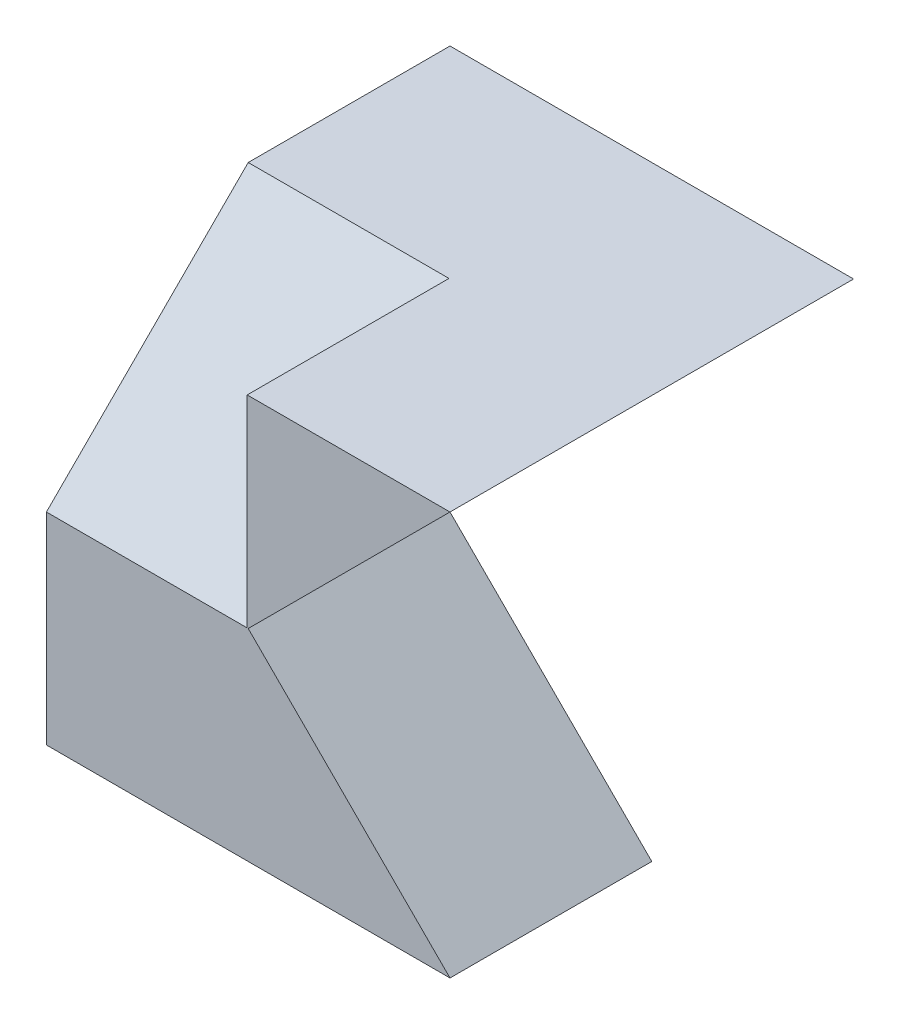
ISO-10303-21;
HEADER;
FILE_DESCRIPTION(('STEP AP214'),'2;1');
FILE_NAME('part.step','',(''),(''),'','','');
FILE_SCHEMA(('AUTOMOTIVE_DESIGN { 1 0 10303 214 1 1 1 1 }'));
ENDSEC;
DATA;
#1=APPLICATION_CONTEXT('core data for automotive mechanical design processes');
#2=APPLICATION_PROTOCOL_DEFINITION('international standard','automotive_design',2000,#1);
#3=PRODUCT_CONTEXT('',#1,'mechanical');
#4=PRODUCT('Part','Part','',(#3));
#5=PRODUCT_RELATED_PRODUCT_CATEGORY('part','',(#4));
#6=PRODUCT_DEFINITION_FORMATION('','',#4);
#7=PRODUCT_DEFINITION_CONTEXT('part definition',#1,'design');
#8=PRODUCT_DEFINITION('design','',#6,#7);
#9=PRODUCT_DEFINITION_SHAPE('','',#8);
#10=(LENGTH_UNIT() NAMED_UNIT(*) SI_UNIT(.MILLI.,.METRE.));
#11=(NAMED_UNIT(*) PLANE_ANGLE_UNIT() SI_UNIT($,.RADIAN.));
#12=(NAMED_UNIT(*) SI_UNIT($,.STERADIAN.) SOLID_ANGLE_UNIT());
#13=UNCERTAINTY_MEASURE_WITH_UNIT(LENGTH_MEASURE(1.E-05),#10,'distance_accuracy_value','');
#14=(GEOMETRIC_REPRESENTATION_CONTEXT(3) GLOBAL_UNCERTAINTY_ASSIGNED_CONTEXT((#13)) GLOBAL_UNIT_ASSIGNED_CONTEXT((#10,
#11,#12)) REPRESENTATION_CONTEXT('',''));
#15=CARTESIAN_POINT('',(0.,0.,0.));
#16=DIRECTION('',(0.,0.,1.));
#17=DIRECTION('',(1.,0.,0.));
#18=AXIS2_PLACEMENT_3D('',#15,#16,#17);
#19=CARTESIAN_POINT('',(4.,0.,4.));
#20=DIRECTION('',(0.,1.,0.));
#21=DIRECTION('',(-1.,0.,0.));
#22=AXIS2_PLACEMENT_3D('',#19,#20,#21);
#23=PLANE('',#22);
#24=DIRECTION('',(0.,0.,-1.));
#25=VECTOR('',#24,1.);
#26=CARTESIAN_POINT('',(0.,0.,4.));
#27=LINE('',#26,#25);
#28=CARTESIAN_POINT('',(0.,0.,4.));
#29=VERTEX_POINT('',#28);
#30=CARTESIAN_POINT('',(0.,0.,2.));
#31=VERTEX_POINT('',#30);
#32=EDGE_CURVE('E118',#29,#31,#27,.T.);
#33=ORIENTED_EDGE('',*,*,#32,.T.);
#34=DIRECTION('',(-1.,0.,0.));
#35=VECTOR('',#34,1.);
#36=CARTESIAN_POINT('',(21.99,0.,2.));
#37=LINE('',#36,#35);
#38=CARTESIAN_POINT('',(4.,0.,2.));
#39=VERTEX_POINT('',#38);
#40=EDGE_CURVE('E100',#39,#31,#37,.T.);
#41=ORIENTED_EDGE('',*,*,#40,.F.);
#42=DIRECTION('',(0.,0.,-1.));
#43=VECTOR('',#42,1.);
#44=CARTESIAN_POINT('',(4.,0.,4.));
#45=LINE('',#44,#43);
#46=CARTESIAN_POINT('',(4.,0.,4.));
#47=VERTEX_POINT('',#46);
#48=EDGE_CURVE('E40',#47,#39,#45,.T.);
#49=ORIENTED_EDGE('',*,*,#48,.F.);
#50=DIRECTION('',(1.,0.,0.));
#51=VECTOR('',#50,1.);
#52=CARTESIAN_POINT('',(4.,0.,4.));
#53=LINE('',#52,#51);
#54=EDGE_CURVE('E122',#29,#47,#53,.T.);
#55=ORIENTED_EDGE('',*,*,#54,.F.);
#56=EDGE_LOOP('',(#33,#41,#49,#55));
#57=FACE_BOUND('',#56,.T.);
#58=ADVANCED_FACE('F33',(#57),#23,.F.);
#59=CARTESIAN_POINT('',(0.,4.,4.));
#60=DIRECTION('',(0.,-1.,0.));
#61=DIRECTION('',(0.,0.,-1.));
#62=AXIS2_PLACEMENT_3D('',#59,#60,#61);
#63=PLANE('',#62);
#64=DIRECTION('',(0.,0.,-1.));
#65=VECTOR('',#64,1.);
#66=CARTESIAN_POINT('',(0.,4.,4.));
#67=LINE('',#66,#65);
#68=CARTESIAN_POINT('',(0.,4.,2.));
#69=VERTEX_POINT('',#68);
#70=CARTESIAN_POINT('',(0.,4.,0.));
#71=VERTEX_POINT('',#70);
#72=EDGE_CURVE('E123',#69,#71,#67,.T.);
#73=ORIENTED_EDGE('',*,*,#72,.F.);
#74=DIRECTION('',(-1.,0.,0.));
#75=VECTOR('',#74,1.);
#76=CARTESIAN_POINT('',(1.99,4.,2.));
#77=LINE('',#76,#75);
#78=CARTESIAN_POINT('',(1.99,4.,2.));
#79=VERTEX_POINT('',#78);
#80=EDGE_CURVE('E166',#79,#69,#77,.T.);
#81=ORIENTED_EDGE('',*,*,#80,.F.);
#82=DIRECTION('',(0.,0.,-1.));
#83=VECTOR('',#82,1.);
#84=CARTESIAN_POINT('',(1.99,4.,4.));
#85=LINE('',#84,#83);
#86=CARTESIAN_POINT('',(1.99,4.,4.));
#87=VERTEX_POINT('',#86);
#88=EDGE_CURVE('E175',#87,#79,#85,.T.);
#89=ORIENTED_EDGE('',*,*,#88,.F.);
#90=DIRECTION('',(-1.,0.,0.));
#91=VECTOR('',#90,1.);
#92=CARTESIAN_POINT('',(0.,4.,4.));
#93=LINE('',#92,#91);
#94=CARTESIAN_POINT('',(4.,4.,4.));
#95=VERTEX_POINT('',#94);
#96=EDGE_CURVE('E128',#95,#87,#93,.T.);
#97=ORIENTED_EDGE('',*,*,#96,.F.);
#98=DIRECTION('',(0.,0.,-1.));
#99=VECTOR('',#98,1.);
#100=CARTESIAN_POINT('',(4.,4.,4.));
#101=LINE('',#100,#99);
#102=CARTESIAN_POINT('',(4.,4.,0.));
#103=VERTEX_POINT('',#102);
#104=EDGE_CURVE('E126',#95,#103,#101,.T.);
#105=ORIENTED_EDGE('',*,*,#104,.T.);
#106=DIRECTION('',(-1.,0.,0.));
#107=VECTOR('',#106,1.);
#108=CARTESIAN_POINT('',(0.,4.,0.));
#109=LINE('',#108,#107);
#110=EDGE_CURVE('E153',#103,#71,#109,.T.);
#111=ORIENTED_EDGE('',*,*,#110,.T.);
#112=EDGE_LOOP('',(#73,#81,#89,#97,#105,#111));
#113=FACE_BOUND('',#112,.T.);
#114=ADVANCED_FACE('F184',(#113),#63,.F.);
#115=CARTESIAN_POINT('',(0.,0.,4.));
#116=DIRECTION('',(1.,0.,0.));
#117=DIRECTION('',(0.,0.,-1.));
#118=AXIS2_PLACEMENT_3D('',#115,#116,#117);
#119=PLANE('',#118);
#120=DIRECTION('',(0.,-1.,0.));
#121=VECTOR('',#120,1.);
#122=CARTESIAN_POINT('',(0.,0.,0.));
#123=LINE('',#122,#121);
#124=CARTESIAN_POINT('',(0.,2.,0.));
#125=VERTEX_POINT('',#124);
#126=EDGE_CURVE('E131',#71,#125,#123,.T.);
#127=ORIENTED_EDGE('',*,*,#126,.T.);
#128=DIRECTION('',(0.,0.,-1.));
#129=VECTOR('',#128,1.);
#130=CARTESIAN_POINT('',(0.,2.,0.));
#131=LINE('',#130,#129);
#132=CARTESIAN_POINT('',(0.,2.,2.));
#133=VERTEX_POINT('',#132);
#134=EDGE_CURVE('E111',#133,#125,#131,.T.);
#135=ORIENTED_EDGE('',*,*,#134,.F.);
#136=DIRECTION('',(0.,1.,0.));
#137=VECTOR('',#136,1.);
#138=CARTESIAN_POINT('',(0.,0.,2.));
#139=LINE('',#138,#137);
#140=EDGE_CURVE('E104',#31,#133,#139,.T.);
#141=ORIENTED_EDGE('',*,*,#140,.F.);
#142=ORIENTED_EDGE('',*,*,#32,.F.);
#143=DIRECTION('',(0.,-1.,0.));
#144=VECTOR('',#143,1.);
#145=CARTESIAN_POINT('',(0.,0.,4.));
#146=LINE('',#145,#144);
#147=CARTESIAN_POINT('',(0.,2.,4.));
#148=VERTEX_POINT('',#147);
#149=EDGE_CURVE('E124',#148,#29,#146,.T.);
#150=ORIENTED_EDGE('',*,*,#149,.F.);
#151=DIRECTION('',(0.,-0.707106781186547,0.707106781186548));
#152=VECTOR('',#151,1.);
#153=CARTESIAN_POINT('',(0.,4.,2.));
#154=LINE('',#153,#152);
#155=EDGE_CURVE('E171',#69,#148,#154,.T.);
#156=ORIENTED_EDGE('',*,*,#155,.F.);
#157=ORIENTED_EDGE('',*,*,#72,.T.);
#158=EDGE_LOOP('',(#127,#135,#141,#142,#150,#156,#157));
#159=FACE_BOUND('',#158,.T.);
#160=ADVANCED_FACE('F116',(#159),#119,.F.);
#161=CARTESIAN_POINT('',(0.,0.,4.));
#162=DIRECTION('',(0.,0.,-1.));
#163=DIRECTION('',(-1.,0.,0.));
#164=AXIS2_PLACEMENT_3D('',#161,#162,#163);
#165=PLANE('',#164);
#166=DIRECTION('',(0.,1.,0.));
#167=VECTOR('',#166,1.);
#168=CARTESIAN_POINT('',(1.99,4.,4.));
#169=LINE('',#168,#167);
#170=CARTESIAN_POINT('',(1.99,2.,4.));
#171=VERTEX_POINT('',#170);
#172=EDGE_CURVE('E173',#171,#87,#169,.T.);
#173=ORIENTED_EDGE('',*,*,#172,.F.);
#174=DIRECTION('',(-1.,0.,0.));
#175=VECTOR('',#174,1.);
#176=CARTESIAN_POINT('',(1.99,2.,4.));
#177=LINE('',#176,#175);
#178=EDGE_CURVE('E168',#171,#148,#177,.T.);
#179=ORIENTED_EDGE('',*,*,#178,.T.);
#180=ORIENTED_EDGE('',*,*,#149,.T.);
#181=ORIENTED_EDGE('',*,*,#54,.T.);
#182=DIRECTION('',(0.707106781186554,-0.707106781186541,0.));
#183=VECTOR('',#182,1.);
#184=CARTESIAN_POINT('',(2.,1.99999999999997,4.));
#185=LINE('',#184,#183);
#186=CARTESIAN_POINT('',(2.,1.99999999999997,4.));
#187=VERTEX_POINT('',#186);
#188=EDGE_CURVE('E139',#187,#47,#185,.T.);
#189=ORIENTED_EDGE('',*,*,#188,.F.);
#190=DIRECTION('',(-0.707106781186541,-0.707106781186554,0.));
#191=VECTOR('',#190,1.);
#192=CARTESIAN_POINT('',(4.,4.,4.));
#193=LINE('',#192,#191);
#194=EDGE_CURVE('E145',#95,#187,#193,.T.);
#195=ORIENTED_EDGE('',*,*,#194,.F.);
#196=ORIENTED_EDGE('',*,*,#96,.T.);
#197=EDGE_LOOP('',(#173,#179,#180,#181,#189,#195,#196));
#198=FACE_BOUND('',#197,.T.);
#199=ADVANCED_FACE('F148',(#198),#165,.F.);
#200=CARTESIAN_POINT('',(0.,0.,0.));
#201=DIRECTION('',(0.,0.,-1.));
#202=DIRECTION('',(-1.,0.,0.));
#203=AXIS2_PLACEMENT_3D('',#200,#201,#202);
#204=PLANE('',#203);
#205=DIRECTION('',(-1.,0.,0.));
#206=VECTOR('',#205,1.);
#207=CARTESIAN_POINT('',(21.99,2.,0.));
#208=LINE('',#207,#206);
#209=CARTESIAN_POINT('',(2.,1.99999999999997,0.));
#210=VERTEX_POINT('',#209);
#211=EDGE_CURVE('E55',#210,#125,#208,.T.);
#212=ORIENTED_EDGE('',*,*,#211,.T.);
#213=ORIENTED_EDGE('',*,*,#126,.F.);
#214=ORIENTED_EDGE('',*,*,#110,.F.);
#215=DIRECTION('',(-0.707106781186541,-0.707106781186554,0.));
#216=VECTOR('',#215,1.);
#217=CARTESIAN_POINT('',(4.,4.,0.));
#218=LINE('',#217,#216);
#219=EDGE_CURVE('E144',#103,#210,#218,.T.);
#220=ORIENTED_EDGE('',*,*,#219,.T.);
#221=EDGE_LOOP('',(#212,#213,#214,#220));
#222=FACE_BOUND('',#221,.T.);
#223=ADVANCED_FACE('F181',(#222),#204,.T.);
#224=CARTESIAN_POINT('',(2.,1.99999999999997,0.));
#225=DIRECTION('',(-0.707106781186541,-0.707106781186554,0.));
#226=DIRECTION('',(0.707106781186554,-0.707106781186541,0.));
#227=AXIS2_PLACEMENT_3D('',#224,#225,#226);
#228=PLANE('',#227);
#229=ORIENTED_EDGE('',*,*,#48,.T.);
#230=DIRECTION('',(-0.707106781186554,0.707106781186541,0.));
#231=VECTOR('',#230,1.);
#232=CARTESIAN_POINT('',(2.,1.99999999999997,2.));
#233=LINE('',#232,#231);
#234=CARTESIAN_POINT('',(2.00000000000003,2.,2.));
#235=VERTEX_POINT('',#234);
#236=EDGE_CURVE('E11',#39,#235,#233,.T.);
#237=ORIENTED_EDGE('',*,*,#236,.T.);
#238=DIRECTION('',(0.,0.,1.));
#239=VECTOR('',#238,1.);
#240=CARTESIAN_POINT('',(2.,1.99999999999997,0.));
#241=LINE('',#240,#239);
#242=EDGE_CURVE('E140',#235,#187,#241,.T.);
#243=ORIENTED_EDGE('',*,*,#242,.T.);
#244=ORIENTED_EDGE('',*,*,#188,.T.);
#245=EDGE_LOOP('',(#229,#237,#243,#244));
#246=FACE_BOUND('',#245,.T.);
#247=ADVANCED_FACE('F136',(#246),#228,.F.);
#248=CARTESIAN_POINT('',(4.,4.,0.));
#249=DIRECTION('',(-0.707106781186554,0.707106781186541,0.));
#250=DIRECTION('',(-0.707106781186541,-0.707106781186554,0.));
#251=AXIS2_PLACEMENT_3D('',#248,#249,#250);
#252=PLANE('',#251);
#253=ORIENTED_EDGE('',*,*,#194,.T.);
#254=ORIENTED_EDGE('',*,*,#242,.F.);
#255=EDGE_CURVE('E155',#210,#235,#241,.T.);
#256=ORIENTED_EDGE('',*,*,#255,.F.);
#257=ORIENTED_EDGE('',*,*,#219,.F.);
#258=ORIENTED_EDGE('',*,*,#104,.F.);
#259=EDGE_LOOP('',(#253,#254,#256,#257,#258));
#260=FACE_BOUND('',#259,.T.);
#261=ADVANCED_FACE('F197',(#260),#252,.F.);
#262=CARTESIAN_POINT('',(1.99,4.,2.));
#263=DIRECTION('',(0.,-0.707106781186548,-0.707106781186547));
#264=DIRECTION('',(0.,0.707106781186547,-0.707106781186548));
#265=AXIS2_PLACEMENT_3D('',#262,#263,#264);
#266=PLANE('',#265);
#267=ORIENTED_EDGE('',*,*,#155,.T.);
#268=ORIENTED_EDGE('',*,*,#178,.F.);
#269=DIRECTION('',(0.,-0.707106781186547,0.707106781186548));
#270=VECTOR('',#269,1.);
#271=CARTESIAN_POINT('',(1.99,4.,2.));
#272=LINE('',#271,#270);
#273=EDGE_CURVE('E47',#79,#171,#272,.T.);
#274=ORIENTED_EDGE('',*,*,#273,.F.);
#275=ORIENTED_EDGE('',*,*,#80,.T.);
#276=EDGE_LOOP('',(#267,#268,#274,#275));
#277=FACE_BOUND('',#276,.T.);
#278=ADVANCED_FACE('F188',(#277),#266,.F.);
#279=CARTESIAN_POINT('',(1.99,0.,0.));
#280=DIRECTION('',(1.,0.,0.));
#281=DIRECTION('',(0.,0.,-1.));
#282=AXIS2_PLACEMENT_3D('',#279,#280,#281);
#283=PLANE('',#282);
#284=ORIENTED_EDGE('',*,*,#172,.T.);
#285=ORIENTED_EDGE('',*,*,#88,.T.);
#286=ORIENTED_EDGE('',*,*,#273,.T.);
#287=EDGE_LOOP('',(#284,#285,#286));
#288=FACE_BOUND('',#287,.T.);
#289=ADVANCED_FACE('F189',(#288),#283,.F.);
#290=CARTESIAN_POINT('',(21.99,0.,2.));
#291=DIRECTION('',(0.,0.,1.));
#292=DIRECTION('',(0.,-1.,0.));
#293=AXIS2_PLACEMENT_3D('',#290,#291,#292);
#294=PLANE('',#293);
#295=ORIENTED_EDGE('',*,*,#40,.T.);
#296=ORIENTED_EDGE('',*,*,#140,.T.);
#297=DIRECTION('',(-1.,0.,0.));
#298=VECTOR('',#297,1.);
#299=CARTESIAN_POINT('',(21.99,2.,2.));
#300=LINE('',#299,#298);
#301=EDGE_CURVE('E110',#235,#133,#300,.T.);
#302=ORIENTED_EDGE('',*,*,#301,.F.);
#303=ORIENTED_EDGE('',*,*,#236,.F.);
#304=EDGE_LOOP('',(#295,#296,#302,#303));
#305=FACE_BOUND('',#304,.T.);
#306=ADVANCED_FACE('F102',(#305),#294,.F.);
#307=CARTESIAN_POINT('',(21.99,2.,0.));
#308=DIRECTION('',(0.,1.,0.));
#309=DIRECTION('',(0.,0.,1.));
#310=AXIS2_PLACEMENT_3D('',#307,#308,#309);
#311=PLANE('',#310);
#312=ORIENTED_EDGE('',*,*,#301,.T.);
#313=ORIENTED_EDGE('',*,*,#134,.T.);
#314=ORIENTED_EDGE('',*,*,#211,.F.);
#315=ORIENTED_EDGE('',*,*,#255,.T.);
#316=EDGE_LOOP('',(#312,#313,#314,#315));
#317=FACE_BOUND('',#316,.T.);
#318=ADVANCED_FACE('F180',(#317),#311,.F.);
#319=CLOSED_SHELL('',(#58,#114,#160,#199,#223,#247,#261,#278,#289,#306,#318));
#320=MANIFOLD_SOLID_BREP('B2',#319);
#321=ADVANCED_BREP_SHAPE_REPRESENTATION('',(#18,#320),#14);
#322=SHAPE_DEFINITION_REPRESENTATION(#9,#321);
ENDSEC;
END-ISO-10303-21;
